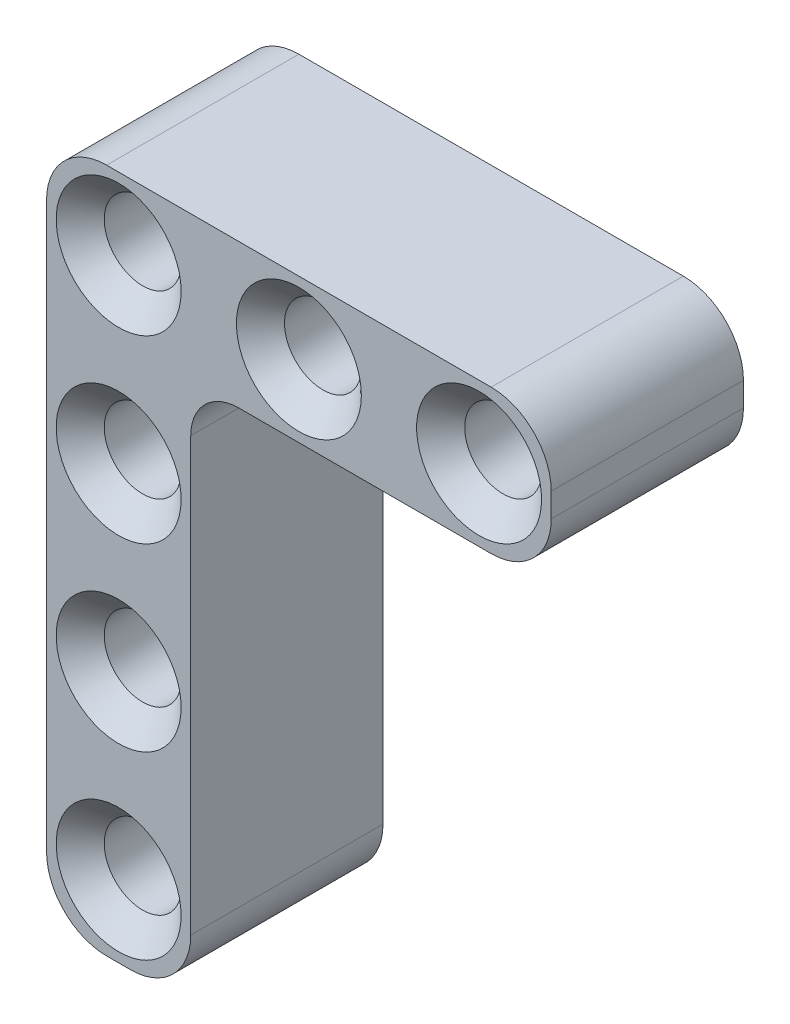
ISO-10303-21;
HEADER;
FILE_DESCRIPTION(('STEP AP214'),'2;1');
FILE_NAME('part.step','',(''),(''),'','','');
FILE_SCHEMA(('AUTOMOTIVE_DESIGN { 1 0 10303 214 1 1 1 1 }'));
ENDSEC;
DATA;
#1=APPLICATION_CONTEXT('core data for automotive mechanical design processes');
#2=APPLICATION_PROTOCOL_DEFINITION('international standard','automotive_design',2000,#1);
#3=PRODUCT_CONTEXT('',#1,'mechanical');
#4=PRODUCT('Part','Part','',(#3));
#5=PRODUCT_RELATED_PRODUCT_CATEGORY('part','',(#4));
#6=PRODUCT_DEFINITION_FORMATION('','',#4);
#7=PRODUCT_DEFINITION_CONTEXT('part definition',#1,'design');
#8=PRODUCT_DEFINITION('design','',#6,#7);
#9=PRODUCT_DEFINITION_SHAPE('','',#8);
#10=(LENGTH_UNIT() NAMED_UNIT(*) SI_UNIT(.MILLI.,.METRE.));
#11=(NAMED_UNIT(*) PLANE_ANGLE_UNIT() SI_UNIT($,.RADIAN.));
#12=(NAMED_UNIT(*) SI_UNIT($,.STERADIAN.) SOLID_ANGLE_UNIT());
#13=UNCERTAINTY_MEASURE_WITH_UNIT(LENGTH_MEASURE(1.E-05),#10,'distance_accuracy_value','');
#14=(GEOMETRIC_REPRESENTATION_CONTEXT(3) GLOBAL_UNCERTAINTY_ASSIGNED_CONTEXT((#13)) GLOBAL_UNIT_ASSIGNED_CONTEXT((#10,
#11,#12)) REPRESENTATION_CONTEXT('',''));
#15=CARTESIAN_POINT('',(0.,0.,0.));
#16=DIRECTION('',(0.,0.,1.));
#17=DIRECTION('',(1.,0.,0.));
#18=AXIS2_PLACEMENT_3D('',#15,#16,#17);
#19=CARTESIAN_POINT('',(15.5,-0.5,8.));
#20=DIRECTION('',(0.,0.,1.));
#21=DIRECTION('',(1.,0.,0.));
#22=AXIS2_PLACEMENT_3D('',#19,#20,#21);
#23=PLANE('',#22);
#24=CARTESIAN_POINT('',(0.,-7.5,8.));
#25=DIRECTION('',(0.,0.,1.));
#26=DIRECTION('',(1.,0.,0.));
#27=AXIS2_PLACEMENT_3D('',#24,#25,#26);
#28=CIRCLE('',#27,2.60000000000002);
#29=CARTESIAN_POINT('',(2.60000000000005,-7.5,8.));
#30=VERTEX_POINT('',#29);
#31=EDGE_CURVE('E270',#30,#30,#28,.F.);
#32=ORIENTED_EDGE('',*,*,#31,.T.);
#33=EDGE_LOOP('',(#32));
#34=FACE_BOUND('',#33,.T.);
#35=CARTESIAN_POINT('',(1.10050857315969E-13,-15.,8.));
#36=DIRECTION('',(0.,0.,1.));
#37=DIRECTION('',(1.,0.,0.));
#38=AXIS2_PLACEMENT_3D('',#35,#36,#37);
#39=CIRCLE('',#38,2.60000000000001);
#40=CARTESIAN_POINT('',(2.60000000000012,-15.,8.));
#41=VERTEX_POINT('',#40);
#42=EDGE_CURVE('E267',#41,#41,#39,.F.);
#43=ORIENTED_EDGE('',*,*,#42,.T.);
#44=EDGE_LOOP('',(#43));
#45=FACE_BOUND('',#44,.T.);
#46=CARTESIAN_POINT('',(1.88609187439939E-13,-22.5,8.));
#47=DIRECTION('',(0.,0.,1.));
#48=DIRECTION('',(1.,0.,0.));
#49=AXIS2_PLACEMENT_3D('',#46,#47,#48);
#50=CIRCLE('',#49,2.60000000000002);
#51=CARTESIAN_POINT('',(2.6000000000002,-22.5,8.));
#52=VERTEX_POINT('',#51);
#53=EDGE_CURVE('E264',#52,#52,#50,.F.);
#54=ORIENTED_EDGE('',*,*,#53,.T.);
#55=EDGE_LOOP('',(#54));
#56=FACE_BOUND('',#55,.T.);
#57=CARTESIAN_POINT('',(15.,0.,8.));
#58=DIRECTION('',(0.,0.,1.));
#59=DIRECTION('',(1.,0.,0.));
#60=AXIS2_PLACEMENT_3D('',#57,#58,#59);
#61=CIRCLE('',#60,2.6);
#62=CARTESIAN_POINT('',(17.6,0.,8.));
#63=VERTEX_POINT('',#62);
#64=EDGE_CURVE('E236',#63,#63,#61,.F.);
#65=ORIENTED_EDGE('',*,*,#64,.T.);
#66=EDGE_LOOP('',(#65));
#67=FACE_BOUND('',#66,.T.);
#68=CARTESIAN_POINT('',(7.5,0.,8.));
#69=DIRECTION('',(0.,0.,1.));
#70=DIRECTION('',(1.,0.,0.));
#71=AXIS2_PLACEMENT_3D('',#68,#69,#70);
#72=CIRCLE('',#71,2.6);
#73=CARTESIAN_POINT('',(10.1,0.,8.));
#74=VERTEX_POINT('',#73);
#75=EDGE_CURVE('E233',#74,#74,#72,.F.);
#76=ORIENTED_EDGE('',*,*,#75,.T.);
#77=EDGE_LOOP('',(#76));
#78=FACE_BOUND('',#77,.T.);
#79=CARTESIAN_POINT('',(0.,0.,8.));
#80=DIRECTION('',(0.,0.,1.));
#81=DIRECTION('',(1.,0.,0.));
#82=AXIS2_PLACEMENT_3D('',#79,#80,#81);
#83=CIRCLE('',#82,2.6);
#84=CARTESIAN_POINT('',(2.6,0.,8.));
#85=VERTEX_POINT('',#84);
#86=EDGE_CURVE('E230',#85,#85,#83,.F.);
#87=ORIENTED_EDGE('',*,*,#86,.T.);
#88=EDGE_LOOP('',(#87));
#89=FACE_BOUND('',#88,.T.);
#90=CARTESIAN_POINT('',(15.5,-0.5,8.));
#91=DIRECTION('',(0.,0.,1.));
#92=DIRECTION('',(1.,0.,0.));
#93=AXIS2_PLACEMENT_3D('',#90,#91,#92);
#94=CIRCLE('',#93,2.5);
#95=CARTESIAN_POINT('',(15.5,-3.,8.));
#96=VERTEX_POINT('',#95);
#97=CARTESIAN_POINT('',(18.,-0.5,8.));
#98=VERTEX_POINT('',#97);
#99=EDGE_CURVE('E168',#96,#98,#94,.T.);
#100=ORIENTED_EDGE('',*,*,#99,.T.);
#101=DIRECTION('',(0.,1.,0.));
#102=VECTOR('',#101,1.);
#103=CARTESIAN_POINT('',(18.,0.5,8.));
#104=LINE('',#103,#102);
#105=CARTESIAN_POINT('',(18.,0.5,8.));
#106=VERTEX_POINT('',#105);
#107=EDGE_CURVE('E171',#98,#106,#104,.T.);
#108=ORIENTED_EDGE('',*,*,#107,.T.);
#109=CARTESIAN_POINT('',(15.5,0.5,8.));
#110=DIRECTION('',(0.,0.,1.));
#111=DIRECTION('',(-1.,0.,0.));
#112=AXIS2_PLACEMENT_3D('',#109,#110,#111);
#113=CIRCLE('',#112,2.5);
#114=CARTESIAN_POINT('',(15.5,3.,8.));
#115=VERTEX_POINT('',#114);
#116=EDGE_CURVE('E174',#106,#115,#113,.T.);
#117=ORIENTED_EDGE('',*,*,#116,.T.);
#118=DIRECTION('',(-1.,0.,0.));
#119=VECTOR('',#118,1.);
#120=CARTESIAN_POINT('',(-0.5,3.,8.));
#121=LINE('',#120,#119);
#122=CARTESIAN_POINT('',(-0.5,3.,8.));
#123=VERTEX_POINT('',#122);
#124=EDGE_CURVE('E176',#115,#123,#121,.T.);
#125=ORIENTED_EDGE('',*,*,#124,.T.);
#126=CARTESIAN_POINT('',(-0.5,0.5,8.));
#127=DIRECTION('',(0.,0.,1.));
#128=DIRECTION('',(1.,0.,0.));
#129=AXIS2_PLACEMENT_3D('',#126,#127,#128);
#130=CIRCLE('',#129,2.5);
#131=CARTESIAN_POINT('',(-3.,0.5,8.));
#132=VERTEX_POINT('',#131);
#133=EDGE_CURVE('E178',#123,#132,#130,.T.);
#134=ORIENTED_EDGE('',*,*,#133,.T.);
#135=DIRECTION('',(0.,-1.,0.));
#136=VECTOR('',#135,1.);
#137=CARTESIAN_POINT('',(-3.,0.5,8.));
#138=LINE('',#137,#136);
#139=CARTESIAN_POINT('',(-2.99999999999991,-23.,8.));
#140=VERTEX_POINT('',#139);
#141=EDGE_CURVE('E180',#132,#140,#138,.T.);
#142=ORIENTED_EDGE('',*,*,#141,.T.);
#143=CARTESIAN_POINT('',(-0.499999999999911,-23.,8.));
#144=DIRECTION('',(0.,0.,1.));
#145=DIRECTION('',(1.,0.,0.));
#146=AXIS2_PLACEMENT_3D('',#143,#144,#145);
#147=CIRCLE('',#146,2.5);
#148=CARTESIAN_POINT('',(-0.499999999999901,-25.5,8.));
#149=VERTEX_POINT('',#148);
#150=EDGE_CURVE('E150',#140,#149,#147,.T.);
#151=ORIENTED_EDGE('',*,*,#150,.T.);
#152=DIRECTION('',(1.,0.,0.));
#153=VECTOR('',#152,1.);
#154=CARTESIAN_POINT('',(1.76941794549634E-13,-25.5,8.));
#155=LINE('',#154,#153);
#156=CARTESIAN_POINT('',(0.500000000000099,-25.5,8.));
#157=VERTEX_POINT('',#156);
#158=EDGE_CURVE('E158',#149,#157,#155,.T.);
#159=ORIENTED_EDGE('',*,*,#158,.T.);
#160=CARTESIAN_POINT('',(0.50000000000009,-23.,8.));
#161=DIRECTION('',(0.,0.,1.));
#162=DIRECTION('',(1.,0.,0.));
#163=AXIS2_PLACEMENT_3D('',#160,#161,#162);
#164=CIRCLE('',#163,2.5);
#165=CARTESIAN_POINT('',(3.00000000000009,-23.,8.));
#166=VERTEX_POINT('',#165);
#167=EDGE_CURVE('E129',#157,#166,#164,.T.);
#168=ORIENTED_EDGE('',*,*,#167,.T.);
#169=DIRECTION('',(0.,1.,0.));
#170=VECTOR('',#169,1.);
#171=CARTESIAN_POINT('',(3.,0.,8.));
#172=LINE('',#171,#170);
#173=CARTESIAN_POINT('',(3.00000000000002,-5.00000000000001,8.));
#174=VERTEX_POINT('',#173);
#175=EDGE_CURVE('E153',#166,#174,#172,.T.);
#176=ORIENTED_EDGE('',*,*,#175,.T.);
#177=CARTESIAN_POINT('',(5.00000000000002,-5.,8.));
#178=DIRECTION('',(0.,0.,1.));
#179=DIRECTION('',(1.,0.,0.));
#180=AXIS2_PLACEMENT_3D('',#177,#178,#179);
#181=CIRCLE('',#180,2.);
#182=CARTESIAN_POINT('',(5.00000000000002,-3.,8.));
#183=VERTEX_POINT('',#182);
#184=EDGE_CURVE('E58',#174,#183,#181,.F.);
#185=ORIENTED_EDGE('',*,*,#184,.T.);
#186=DIRECTION('',(1.,0.,0.));
#187=VECTOR('',#186,1.);
#188=CARTESIAN_POINT('',(-0.5,-3.,8.));
#189=LINE('',#188,#187);
#190=EDGE_CURVE('E182',#183,#96,#189,.T.);
#191=ORIENTED_EDGE('',*,*,#190,.T.);
#192=EDGE_LOOP('',(#100,#108,#117,#125,#134,#142,#151,#159,#168,#176,#185,#191));
#193=FACE_BOUND('',#192,.T.);
#194=ADVANCED_FACE('F35',(#34,#45,#56,#67,#78,#89,#193),#23,.T.);
#195=CARTESIAN_POINT('',(15.5,-0.5,0.));
#196=DIRECTION('',(0.,0.,1.));
#197=DIRECTION('',(1.,0.,0.));
#198=AXIS2_PLACEMENT_3D('',#195,#196,#197);
#199=PLANE('',#198);
#200=CARTESIAN_POINT('',(0.,-7.5,0.));
#201=DIRECTION('',(0.,0.,1.));
#202=DIRECTION('',(1.,0.,0.));
#203=AXIS2_PLACEMENT_3D('',#200,#201,#202);
#204=CIRCLE('',#203,2.6);
#205=CARTESIAN_POINT('',(2.60000000000003,-7.5,0.));
#206=VERTEX_POINT('',#205);
#207=EDGE_CURVE('E279',#206,#206,#204,.T.);
#208=ORIENTED_EDGE('',*,*,#207,.T.);
#209=EDGE_LOOP('',(#208));
#210=FACE_BOUND('',#209,.T.);
#211=CARTESIAN_POINT('',(1.10050857315969E-13,-15.,0.));
#212=DIRECTION('',(0.,0.,1.));
#213=DIRECTION('',(1.,0.,0.));
#214=AXIS2_PLACEMENT_3D('',#211,#212,#213);
#215=CIRCLE('',#214,2.6);
#216=CARTESIAN_POINT('',(2.60000000000011,-15.,0.));
#217=VERTEX_POINT('',#216);
#218=EDGE_CURVE('E276',#217,#217,#215,.T.);
#219=ORIENTED_EDGE('',*,*,#218,.T.);
#220=EDGE_LOOP('',(#219));
#221=FACE_BOUND('',#220,.T.);
#222=CARTESIAN_POINT('',(1.88609187439939E-13,-22.5,0.));
#223=DIRECTION('',(0.,0.,1.));
#224=DIRECTION('',(1.,0.,0.));
#225=AXIS2_PLACEMENT_3D('',#222,#223,#224);
#226=CIRCLE('',#225,2.6);
#227=CARTESIAN_POINT('',(2.60000000000019,-22.5,0.));
#228=VERTEX_POINT('',#227);
#229=EDGE_CURVE('E273',#228,#228,#226,.T.);
#230=ORIENTED_EDGE('',*,*,#229,.T.);
#231=EDGE_LOOP('',(#230));
#232=FACE_BOUND('',#231,.T.);
#233=CARTESIAN_POINT('',(15.,0.,0.));
#234=DIRECTION('',(0.,0.,1.));
#235=DIRECTION('',(1.,0.,0.));
#236=AXIS2_PLACEMENT_3D('',#233,#234,#235);
#237=CIRCLE('',#236,2.6);
#238=CARTESIAN_POINT('',(17.6,0.,0.));
#239=VERTEX_POINT('',#238);
#240=EDGE_CURVE('E221',#239,#239,#237,.T.);
#241=ORIENTED_EDGE('',*,*,#240,.T.);
#242=EDGE_LOOP('',(#241));
#243=FACE_BOUND('',#242,.T.);
#244=CARTESIAN_POINT('',(7.5,0.,0.));
#245=DIRECTION('',(0.,0.,1.));
#246=DIRECTION('',(1.,0.,0.));
#247=AXIS2_PLACEMENT_3D('',#244,#245,#246);
#248=CIRCLE('',#247,2.6);
#249=CARTESIAN_POINT('',(10.1,0.,0.));
#250=VERTEX_POINT('',#249);
#251=EDGE_CURVE('E218',#250,#250,#248,.T.);
#252=ORIENTED_EDGE('',*,*,#251,.T.);
#253=EDGE_LOOP('',(#252));
#254=FACE_BOUND('',#253,.T.);
#255=CARTESIAN_POINT('',(0.,0.,0.));
#256=DIRECTION('',(0.,0.,1.));
#257=DIRECTION('',(1.,0.,0.));
#258=AXIS2_PLACEMENT_3D('',#255,#256,#257);
#259=CIRCLE('',#258,2.6);
#260=CARTESIAN_POINT('',(2.6,0.,0.));
#261=VERTEX_POINT('',#260);
#262=EDGE_CURVE('E215',#261,#261,#259,.T.);
#263=ORIENTED_EDGE('',*,*,#262,.T.);
#264=EDGE_LOOP('',(#263));
#265=FACE_BOUND('',#264,.T.);
#266=CARTESIAN_POINT('',(15.5,-0.5,0.));
#267=DIRECTION('',(0.,0.,1.));
#268=DIRECTION('',(1.,0.,0.));
#269=AXIS2_PLACEMENT_3D('',#266,#267,#268);
#270=CIRCLE('',#269,2.5);
#271=CARTESIAN_POINT('',(15.5,-3.,0.));
#272=VERTEX_POINT('',#271);
#273=CARTESIAN_POINT('',(18.,-0.5,0.));
#274=VERTEX_POINT('',#273);
#275=EDGE_CURVE('E163',#272,#274,#270,.T.);
#276=ORIENTED_EDGE('',*,*,#275,.F.);
#277=DIRECTION('',(1.,0.,0.));
#278=VECTOR('',#277,1.);
#279=CARTESIAN_POINT('',(-0.5,-3.,0.));
#280=LINE('',#279,#278);
#281=CARTESIAN_POINT('',(5.00000000000002,-3.,0.));
#282=VERTEX_POINT('',#281);
#283=EDGE_CURVE('E172',#282,#272,#280,.T.);
#284=ORIENTED_EDGE('',*,*,#283,.F.);
#285=CARTESIAN_POINT('',(5.00000000000002,-5.,0.));
#286=DIRECTION('',(0.,0.,1.));
#287=DIRECTION('',(1.,0.,0.));
#288=AXIS2_PLACEMENT_3D('',#285,#286,#287);
#289=CIRCLE('',#288,2.);
#290=CARTESIAN_POINT('',(3.00000000000002,-5.00000000000001,0.));
#291=VERTEX_POINT('',#290);
#292=EDGE_CURVE('E256',#282,#291,#289,.T.);
#293=ORIENTED_EDGE('',*,*,#292,.T.);
#294=DIRECTION('',(0.,1.,0.));
#295=VECTOR('',#294,1.);
#296=CARTESIAN_POINT('',(3.,0.,0.));
#297=LINE('',#296,#295);
#298=CARTESIAN_POINT('',(3.00000000000009,-23.,0.));
#299=VERTEX_POINT('',#298);
#300=EDGE_CURVE('E146',#299,#291,#297,.T.);
#301=ORIENTED_EDGE('',*,*,#300,.F.);
#302=CARTESIAN_POINT('',(0.50000000000009,-23.,0.));
#303=DIRECTION('',(0.,0.,1.));
#304=DIRECTION('',(1.,0.,0.));
#305=AXIS2_PLACEMENT_3D('',#302,#303,#304);
#306=CIRCLE('',#305,2.5);
#307=CARTESIAN_POINT('',(0.500000000000099,-25.5,0.));
#308=VERTEX_POINT('',#307);
#309=EDGE_CURVE('E127',#308,#299,#306,.T.);
#310=ORIENTED_EDGE('',*,*,#309,.F.);
#311=DIRECTION('',(1.,0.,0.));
#312=VECTOR('',#311,1.);
#313=CARTESIAN_POINT('',(1.76941794549634E-13,-25.5,0.));
#314=LINE('',#313,#312);
#315=CARTESIAN_POINT('',(-0.499999999999901,-25.5,0.));
#316=VERTEX_POINT('',#315);
#317=EDGE_CURVE('E143',#316,#308,#314,.T.);
#318=ORIENTED_EDGE('',*,*,#317,.F.);
#319=CARTESIAN_POINT('',(-0.499999999999911,-23.,0.));
#320=DIRECTION('',(0.,0.,1.));
#321=DIRECTION('',(1.,0.,0.));
#322=AXIS2_PLACEMENT_3D('',#319,#320,#321);
#323=CIRCLE('',#322,2.5);
#324=CARTESIAN_POINT('',(-2.99999999999991,-23.,0.));
#325=VERTEX_POINT('',#324);
#326=EDGE_CURVE('E135',#325,#316,#323,.T.);
#327=ORIENTED_EDGE('',*,*,#326,.F.);
#328=DIRECTION('',(0.,-1.,0.));
#329=VECTOR('',#328,1.);
#330=CARTESIAN_POINT('',(-3.,0.5,0.));
#331=LINE('',#330,#329);
#332=CARTESIAN_POINT('',(-3.,0.5,0.));
#333=VERTEX_POINT('',#332);
#334=EDGE_CURVE('E195',#333,#325,#331,.T.);
#335=ORIENTED_EDGE('',*,*,#334,.F.);
#336=CARTESIAN_POINT('',(-0.5,0.5,0.));
#337=DIRECTION('',(0.,0.,1.));
#338=DIRECTION('',(1.,0.,0.));
#339=AXIS2_PLACEMENT_3D('',#336,#337,#338);
#340=CIRCLE('',#339,2.5);
#341=CARTESIAN_POINT('',(-0.5,3.,0.));
#342=VERTEX_POINT('',#341);
#343=EDGE_CURVE('E193',#342,#333,#340,.T.);
#344=ORIENTED_EDGE('',*,*,#343,.F.);
#345=DIRECTION('',(-1.,0.,0.));
#346=VECTOR('',#345,1.);
#347=CARTESIAN_POINT('',(-0.5,3.,0.));
#348=LINE('',#347,#346);
#349=CARTESIAN_POINT('',(15.5,3.,0.));
#350=VERTEX_POINT('',#349);
#351=EDGE_CURVE('E191',#350,#342,#348,.T.);
#352=ORIENTED_EDGE('',*,*,#351,.F.);
#353=CARTESIAN_POINT('',(15.5,0.5,0.));
#354=DIRECTION('',(0.,0.,1.));
#355=DIRECTION('',(-1.,0.,0.));
#356=AXIS2_PLACEMENT_3D('',#353,#354,#355);
#357=CIRCLE('',#356,2.5);
#358=CARTESIAN_POINT('',(18.,0.5,0.));
#359=VERTEX_POINT('',#358);
#360=EDGE_CURVE('E189',#359,#350,#357,.T.);
#361=ORIENTED_EDGE('',*,*,#360,.F.);
#362=DIRECTION('',(0.,1.,0.));
#363=VECTOR('',#362,1.);
#364=CARTESIAN_POINT('',(18.,0.5,0.));
#365=LINE('',#364,#363);
#366=EDGE_CURVE('E187',#274,#359,#365,.T.);
#367=ORIENTED_EDGE('',*,*,#366,.F.);
#368=EDGE_LOOP('',(#276,#284,#293,#301,#310,#318,#327,#335,#344,#352,#361,#367));
#369=FACE_BOUND('',#368,.T.);
#370=ADVANCED_FACE('F141',(#210,#221,#232,#243,#254,#265,#369),#199,.F.);
#371=CARTESIAN_POINT('',(15.5,-0.5,8.));
#372=DIRECTION('',(0.,0.,-1.));
#373=DIRECTION('',(-1.,0.,0.));
#374=AXIS2_PLACEMENT_3D('',#371,#372,#373);
#375=CYLINDRICAL_SURFACE('',#374,2.5);
#376=ORIENTED_EDGE('',*,*,#275,.T.);
#377=DIRECTION('',(0.,0.,-1.));
#378=VECTOR('',#377,1.);
#379=CARTESIAN_POINT('',(18.,-0.5,8.));
#380=LINE('',#379,#378);
#381=EDGE_CURVE('E212',#98,#274,#380,.T.);
#382=ORIENTED_EDGE('',*,*,#381,.F.);
#383=ORIENTED_EDGE('',*,*,#99,.F.);
#384=DIRECTION('',(0.,0.,-1.));
#385=VECTOR('',#384,1.);
#386=CARTESIAN_POINT('',(15.5,-3.,8.));
#387=LINE('',#386,#385);
#388=EDGE_CURVE('E184',#96,#272,#387,.T.);
#389=ORIENTED_EDGE('',*,*,#388,.T.);
#390=EDGE_LOOP('',(#376,#382,#383,#389));
#391=FACE_BOUND('',#390,.T.);
#392=ADVANCED_FACE('F299',(#391),#375,.T.);
#393=CARTESIAN_POINT('',(18.,0.5,8.));
#394=DIRECTION('',(-1.,0.,0.));
#395=DIRECTION('',(0.,0.,1.));
#396=AXIS2_PLACEMENT_3D('',#393,#394,#395);
#397=PLANE('',#396);
#398=ORIENTED_EDGE('',*,*,#366,.T.);
#399=DIRECTION('',(0.,0.,-1.));
#400=VECTOR('',#399,1.);
#401=CARTESIAN_POINT('',(18.,0.5,8.));
#402=LINE('',#401,#400);
#403=EDGE_CURVE('E209',#106,#359,#402,.T.);
#404=ORIENTED_EDGE('',*,*,#403,.F.);
#405=ORIENTED_EDGE('',*,*,#107,.F.);
#406=ORIENTED_EDGE('',*,*,#381,.T.);
#407=EDGE_LOOP('',(#398,#404,#405,#406));
#408=FACE_BOUND('',#407,.T.);
#409=ADVANCED_FACE('F352',(#408),#397,.F.);
#410=CARTESIAN_POINT('',(15.5,0.5,8.));
#411=DIRECTION('',(0.,0.,-1.));
#412=DIRECTION('',(-1.,0.,0.));
#413=AXIS2_PLACEMENT_3D('',#410,#411,#412);
#414=CYLINDRICAL_SURFACE('',#413,2.5);
#415=ORIENTED_EDGE('',*,*,#360,.T.);
#416=DIRECTION('',(0.,0.,-1.));
#417=VECTOR('',#416,1.);
#418=CARTESIAN_POINT('',(15.5,3.,8.));
#419=LINE('',#418,#417);
#420=EDGE_CURVE('E206',#115,#350,#419,.T.);
#421=ORIENTED_EDGE('',*,*,#420,.F.);
#422=ORIENTED_EDGE('',*,*,#116,.F.);
#423=ORIENTED_EDGE('',*,*,#403,.T.);
#424=EDGE_LOOP('',(#415,#421,#422,#423));
#425=FACE_BOUND('',#424,.T.);
#426=ADVANCED_FACE('F348',(#425),#414,.T.);
#427=CARTESIAN_POINT('',(-0.5,3.,8.));
#428=DIRECTION('',(0.,-1.,0.));
#429=DIRECTION('',(1.,0.,0.));
#430=AXIS2_PLACEMENT_3D('',#427,#428,#429);
#431=PLANE('',#430);
#432=ORIENTED_EDGE('',*,*,#351,.T.);
#433=DIRECTION('',(0.,0.,-1.));
#434=VECTOR('',#433,1.);
#435=CARTESIAN_POINT('',(-0.5,3.,8.));
#436=LINE('',#435,#434);
#437=EDGE_CURVE('E203',#123,#342,#436,.T.);
#438=ORIENTED_EDGE('',*,*,#437,.F.);
#439=ORIENTED_EDGE('',*,*,#124,.F.);
#440=ORIENTED_EDGE('',*,*,#420,.T.);
#441=EDGE_LOOP('',(#432,#438,#439,#440));
#442=FACE_BOUND('',#441,.T.);
#443=ADVANCED_FACE('F344',(#442),#431,.F.);
#444=CARTESIAN_POINT('',(-0.5,0.5,8.));
#445=DIRECTION('',(0.,0.,-1.));
#446=DIRECTION('',(-1.,0.,0.));
#447=AXIS2_PLACEMENT_3D('',#444,#445,#446);
#448=CYLINDRICAL_SURFACE('',#447,2.5);
#449=ORIENTED_EDGE('',*,*,#343,.T.);
#450=DIRECTION('',(0.,0.,-1.));
#451=VECTOR('',#450,1.);
#452=CARTESIAN_POINT('',(-3.,0.5,8.));
#453=LINE('',#452,#451);
#454=EDGE_CURVE('E200',#132,#333,#453,.T.);
#455=ORIENTED_EDGE('',*,*,#454,.F.);
#456=ORIENTED_EDGE('',*,*,#133,.F.);
#457=ORIENTED_EDGE('',*,*,#437,.T.);
#458=EDGE_LOOP('',(#449,#455,#456,#457));
#459=FACE_BOUND('',#458,.T.);
#460=ADVANCED_FACE('F340',(#459),#448,.T.);
#461=CARTESIAN_POINT('',(-3.,0.5,8.));
#462=DIRECTION('',(1.,0.,0.));
#463=DIRECTION('',(0.,0.,-1.));
#464=AXIS2_PLACEMENT_3D('',#461,#462,#463);
#465=PLANE('',#464);
#466=ORIENTED_EDGE('',*,*,#334,.T.);
#467=DIRECTION('',(0.,0.,1.));
#468=VECTOR('',#467,1.);
#469=CARTESIAN_POINT('',(-2.99999999999991,-23.,0.));
#470=LINE('',#469,#468);
#471=EDGE_CURVE('E164',#325,#140,#470,.T.);
#472=ORIENTED_EDGE('',*,*,#471,.T.);
#473=ORIENTED_EDGE('',*,*,#141,.F.);
#474=ORIENTED_EDGE('',*,*,#454,.T.);
#475=EDGE_LOOP('',(#466,#472,#473,#474));
#476=FACE_BOUND('',#475,.T.);
#477=ADVANCED_FACE('F337',(#476),#465,.F.);
#478=CARTESIAN_POINT('',(-0.5,-3.,8.));
#479=DIRECTION('',(0.,1.,0.));
#480=DIRECTION('',(-1.,0.,0.));
#481=AXIS2_PLACEMENT_3D('',#478,#479,#480);
#482=PLANE('',#481);
#483=ORIENTED_EDGE('',*,*,#190,.F.);
#484=DIRECTION('',(0.,0.,1.));
#485=VECTOR('',#484,1.);
#486=CARTESIAN_POINT('',(5.00000000000002,-3.,8.));
#487=LINE('',#486,#485);
#488=EDGE_CURVE('E50',#183,#282,#487,.F.);
#489=ORIENTED_EDGE('',*,*,#488,.T.);
#490=ORIENTED_EDGE('',*,*,#283,.T.);
#491=ORIENTED_EDGE('',*,*,#388,.F.);
#492=EDGE_LOOP('',(#483,#489,#490,#491));
#493=FACE_BOUND('',#492,.T.);
#494=ADVANCED_FACE('F334',(#493),#482,.F.);
#495=CARTESIAN_POINT('',(0.,0.,8.));
#496=DIRECTION('',(0.,0.,-1.));
#497=DIRECTION('',(-1.,0.,0.));
#498=AXIS2_PLACEMENT_3D('',#495,#496,#497);
#499=CYLINDRICAL_SURFACE('',#498,1.6);
#500=CARTESIAN_POINT('',(0.,0.,1.00000000000001));
#501=DIRECTION('',(0.,0.,1.));
#502=DIRECTION('',(1.,0.,0.));
#503=AXIS2_PLACEMENT_3D('',#500,#501,#502);
#504=CIRCLE('',#503,1.6);
#505=CARTESIAN_POINT('',(1.6,0.,1.00000000000001));
#506=VERTEX_POINT('',#505);
#507=EDGE_CURVE('E248',#506,#506,#504,.F.);
#508=ORIENTED_EDGE('',*,*,#507,.T.);
#509=EDGE_LOOP('',(#508));
#510=FACE_BOUND('',#509,.T.);
#511=CARTESIAN_POINT('',(0.,0.,7.));
#512=DIRECTION('',(0.,0.,1.));
#513=DIRECTION('',(1.,0.,0.));
#514=AXIS2_PLACEMENT_3D('',#511,#512,#513);
#515=CIRCLE('',#514,1.6);
#516=CARTESIAN_POINT('',(1.6,0.,7.));
#517=VERTEX_POINT('',#516);
#518=EDGE_CURVE('E245',#517,#517,#515,.T.);
#519=ORIENTED_EDGE('',*,*,#518,.T.);
#520=EDGE_LOOP('',(#519));
#521=FACE_BOUND('',#520,.T.);
#522=ADVANCED_FACE('F331',(#510,#521),#499,.F.);
#523=CARTESIAN_POINT('',(7.5,0.,8.));
#524=DIRECTION('',(0.,0.,-1.));
#525=DIRECTION('',(-1.,0.,0.));
#526=AXIS2_PLACEMENT_3D('',#523,#524,#525);
#527=CYLINDRICAL_SURFACE('',#526,1.6);
#528=CARTESIAN_POINT('',(7.5,0.,1.));
#529=DIRECTION('',(0.,0.,1.));
#530=DIRECTION('',(1.,0.,0.));
#531=AXIS2_PLACEMENT_3D('',#528,#529,#530);
#532=CIRCLE('',#531,1.6);
#533=CARTESIAN_POINT('',(9.1,0.,1.));
#534=VERTEX_POINT('',#533);
#535=EDGE_CURVE('E242',#534,#534,#532,.F.);
#536=ORIENTED_EDGE('',*,*,#535,.T.);
#537=EDGE_LOOP('',(#536));
#538=FACE_BOUND('',#537,.T.);
#539=CARTESIAN_POINT('',(7.5,0.,7.));
#540=DIRECTION('',(0.,0.,1.));
#541=DIRECTION('',(1.,0.,0.));
#542=AXIS2_PLACEMENT_3D('',#539,#540,#541);
#543=CIRCLE('',#542,1.6);
#544=CARTESIAN_POINT('',(9.1,0.,7.));
#545=VERTEX_POINT('',#544);
#546=EDGE_CURVE('E239',#545,#545,#543,.T.);
#547=ORIENTED_EDGE('',*,*,#546,.T.);
#548=EDGE_LOOP('',(#547));
#549=FACE_BOUND('',#548,.T.);
#550=ADVANCED_FACE('F376',(#538,#549),#527,.F.);
#551=CARTESIAN_POINT('',(15.,0.,8.));
#552=DIRECTION('',(0.,0.,-1.));
#553=DIRECTION('',(-1.,0.,0.));
#554=AXIS2_PLACEMENT_3D('',#551,#552,#553);
#555=CYLINDRICAL_SURFACE('',#554,1.6);
#556=CARTESIAN_POINT('',(15.,0.,1.));
#557=DIRECTION('',(0.,0.,1.));
#558=DIRECTION('',(1.,0.,0.));
#559=AXIS2_PLACEMENT_3D('',#556,#557,#558);
#560=CIRCLE('',#559,1.6);
#561=CARTESIAN_POINT('',(16.6,0.,1.));
#562=VERTEX_POINT('',#561);
#563=EDGE_CURVE('E227',#562,#562,#560,.F.);
#564=ORIENTED_EDGE('',*,*,#563,.T.);
#565=EDGE_LOOP('',(#564));
#566=FACE_BOUND('',#565,.T.);
#567=CARTESIAN_POINT('',(15.,0.,7.));
#568=DIRECTION('',(0.,0.,1.));
#569=DIRECTION('',(1.,0.,0.));
#570=AXIS2_PLACEMENT_3D('',#567,#568,#569);
#571=CIRCLE('',#570,1.6);
#572=CARTESIAN_POINT('',(16.6,0.,7.));
#573=VERTEX_POINT('',#572);
#574=EDGE_CURVE('E224',#573,#573,#571,.T.);
#575=ORIENTED_EDGE('',*,*,#574,.T.);
#576=EDGE_LOOP('',(#575));
#577=FACE_BOUND('',#576,.T.);
#578=ADVANCED_FACE('F364',(#566,#577),#555,.F.);
#579=CARTESIAN_POINT('',(15.,0.,0.));
#580=DIRECTION('',(0.,0.,-1.));
#581=DIRECTION('',(-1.,0.,0.));
#582=AXIS2_PLACEMENT_3D('',#579,#580,#581);
#583=CONICAL_SURFACE('',#582,2.6,0.785398163397447);
#584=ORIENTED_EDGE('',*,*,#563,.F.);
#585=EDGE_LOOP('',(#584));
#586=FACE_BOUND('',#585,.T.);
#587=ORIENTED_EDGE('',*,*,#240,.F.);
#588=EDGE_LOOP('',(#587));
#589=FACE_BOUND('',#588,.T.);
#590=ADVANCED_FACE('F360',(#586,#589),#583,.F.);
#591=CARTESIAN_POINT('',(15.,0.,7.));
#592=DIRECTION('',(0.,0.,1.));
#593=DIRECTION('',(1.,0.,0.));
#594=AXIS2_PLACEMENT_3D('',#591,#592,#593);
#595=CONICAL_SURFACE('',#594,1.6,0.78539816339745);
#596=ORIENTED_EDGE('',*,*,#64,.F.);
#597=EDGE_LOOP('',(#596));
#598=FACE_BOUND('',#597,.T.);
#599=ORIENTED_EDGE('',*,*,#574,.F.);
#600=EDGE_LOOP('',(#599));
#601=FACE_BOUND('',#600,.T.);
#602=ADVANCED_FACE('F363',(#598,#601),#595,.F.);
#603=CARTESIAN_POINT('',(7.5,0.,0.));
#604=DIRECTION('',(0.,0.,-1.));
#605=DIRECTION('',(-1.,0.,0.));
#606=AXIS2_PLACEMENT_3D('',#603,#604,#605);
#607=CONICAL_SURFACE('',#606,2.6,0.785398163397445);
#608=ORIENTED_EDGE('',*,*,#535,.F.);
#609=EDGE_LOOP('',(#608));
#610=FACE_BOUND('',#609,.T.);
#611=ORIENTED_EDGE('',*,*,#251,.F.);
#612=EDGE_LOOP('',(#611));
#613=FACE_BOUND('',#612,.T.);
#614=ADVANCED_FACE('F320',(#610,#613),#607,.F.);
#615=CARTESIAN_POINT('',(7.5,0.,7.));
#616=DIRECTION('',(0.,0.,1.));
#617=DIRECTION('',(1.,0.,0.));
#618=AXIS2_PLACEMENT_3D('',#615,#616,#617);
#619=CONICAL_SURFACE('',#618,1.6,0.785398163397451);
#620=ORIENTED_EDGE('',*,*,#75,.F.);
#621=EDGE_LOOP('',(#620));
#622=FACE_BOUND('',#621,.T.);
#623=ORIENTED_EDGE('',*,*,#546,.F.);
#624=EDGE_LOOP('',(#623));
#625=FACE_BOUND('',#624,.T.);
#626=ADVANCED_FACE('F311',(#622,#625),#619,.F.);
#627=CARTESIAN_POINT('',(0.,0.,0.));
#628=DIRECTION('',(0.,0.,-1.));
#629=DIRECTION('',(-1.,0.,0.));
#630=AXIS2_PLACEMENT_3D('',#627,#628,#629);
#631=CONICAL_SURFACE('',#630,2.6,0.785398163397445);
#632=ORIENTED_EDGE('',*,*,#507,.F.);
#633=EDGE_LOOP('',(#632));
#634=FACE_BOUND('',#633,.T.);
#635=ORIENTED_EDGE('',*,*,#262,.F.);
#636=EDGE_LOOP('',(#635));
#637=FACE_BOUND('',#636,.T.);
#638=ADVANCED_FACE('F308',(#634,#637),#631,.F.);
#639=CARTESIAN_POINT('',(0.,0.,7.));
#640=DIRECTION('',(0.,0.,1.));
#641=DIRECTION('',(1.,0.,0.));
#642=AXIS2_PLACEMENT_3D('',#639,#640,#641);
#643=CONICAL_SURFACE('',#642,1.6,0.785398163397451);
#644=ORIENTED_EDGE('',*,*,#86,.F.);
#645=EDGE_LOOP('',(#644));
#646=FACE_BOUND('',#645,.T.);
#647=ORIENTED_EDGE('',*,*,#518,.F.);
#648=EDGE_LOOP('',(#647));
#649=FACE_BOUND('',#648,.T.);
#650=ADVANCED_FACE('F310',(#646,#649),#643,.F.);
#651=CARTESIAN_POINT('',(1.76941794549634E-13,-25.5,0.));
#652=DIRECTION('',(0.,-1.,0.));
#653=DIRECTION('',(1.,0.,0.));
#654=AXIS2_PLACEMENT_3D('',#651,#652,#653);
#655=PLANE('',#654);
#656=ORIENTED_EDGE('',*,*,#158,.F.);
#657=DIRECTION('',(0.,0.,1.));
#658=VECTOR('',#657,1.);
#659=CARTESIAN_POINT('',(-0.499999999999901,-25.5,0.));
#660=LINE('',#659,#658);
#661=EDGE_CURVE('E149',#316,#149,#660,.T.);
#662=ORIENTED_EDGE('',*,*,#661,.F.);
#663=ORIENTED_EDGE('',*,*,#317,.T.);
#664=DIRECTION('',(0.,0.,1.));
#665=VECTOR('',#664,1.);
#666=CARTESIAN_POINT('',(0.500000000000099,-25.5,0.));
#667=LINE('',#666,#665);
#668=EDGE_CURVE('E124',#308,#157,#667,.T.);
#669=ORIENTED_EDGE('',*,*,#668,.T.);
#670=EDGE_LOOP('',(#656,#662,#663,#669));
#671=FACE_BOUND('',#670,.T.);
#672=ADVANCED_FACE('F148',(#671),#655,.T.);
#673=CARTESIAN_POINT('',(-0.499999999999911,-23.,0.));
#674=DIRECTION('',(0.,0.,1.));
#675=DIRECTION('',(1.,0.,0.));
#676=AXIS2_PLACEMENT_3D('',#673,#674,#675);
#677=CYLINDRICAL_SURFACE('',#676,2.5);
#678=ORIENTED_EDGE('',*,*,#150,.F.);
#679=ORIENTED_EDGE('',*,*,#471,.F.);
#680=ORIENTED_EDGE('',*,*,#326,.T.);
#681=ORIENTED_EDGE('',*,*,#661,.T.);
#682=EDGE_LOOP('',(#678,#679,#680,#681));
#683=FACE_BOUND('',#682,.T.);
#684=ADVANCED_FACE('F403',(#683),#677,.T.);
#685=CARTESIAN_POINT('',(3.,0.,0.));
#686=DIRECTION('',(1.,0.,0.));
#687=DIRECTION('',(0.,1.,0.));
#688=AXIS2_PLACEMENT_3D('',#685,#686,#687);
#689=PLANE('',#688);
#690=ORIENTED_EDGE('',*,*,#300,.T.);
#691=DIRECTION('',(0.,0.,1.));
#692=VECTOR('',#691,1.);
#693=CARTESIAN_POINT('',(3.00000000000002,-5.00000000000001,0.));
#694=LINE('',#693,#692);
#695=EDGE_CURVE('E251',#291,#174,#694,.T.);
#696=ORIENTED_EDGE('',*,*,#695,.T.);
#697=ORIENTED_EDGE('',*,*,#175,.F.);
#698=DIRECTION('',(0.,0.,1.));
#699=VECTOR('',#698,1.);
#700=CARTESIAN_POINT('',(3.00000000000009,-23.,0.));
#701=LINE('',#700,#699);
#702=EDGE_CURVE('E134',#299,#166,#701,.T.);
#703=ORIENTED_EDGE('',*,*,#702,.F.);
#704=EDGE_LOOP('',(#690,#696,#697,#703));
#705=FACE_BOUND('',#704,.T.);
#706=ADVANCED_FACE('F399',(#705),#689,.T.);
#707=CARTESIAN_POINT('',(0.,-7.5,0.));
#708=DIRECTION('',(0.,0.,1.));
#709=DIRECTION('',(1.,0.,0.));
#710=AXIS2_PLACEMENT_3D('',#707,#708,#709);
#711=CYLINDRICAL_SURFACE('',#710,1.6);
#712=CARTESIAN_POINT('',(0.,-7.5,6.99999999999999));
#713=DIRECTION('',(0.,0.,1.));
#714=DIRECTION('',(1.,0.,0.));
#715=AXIS2_PLACEMENT_3D('',#712,#713,#714);
#716=CIRCLE('',#715,1.6);
#717=CARTESIAN_POINT('',(1.60000000000003,-7.5,6.99999999999999));
#718=VERTEX_POINT('',#717);
#719=EDGE_CURVE('E261',#718,#718,#716,.T.);
#720=ORIENTED_EDGE('',*,*,#719,.T.);
#721=EDGE_LOOP('',(#720));
#722=FACE_BOUND('',#721,.T.);
#723=CARTESIAN_POINT('',(0.,-7.5,1.00000000000001));
#724=DIRECTION('',(0.,0.,1.));
#725=DIRECTION('',(1.,0.,0.));
#726=AXIS2_PLACEMENT_3D('',#723,#724,#725);
#727=CIRCLE('',#726,1.6);
#728=CARTESIAN_POINT('',(1.60000000000003,-7.5,1.00000000000001));
#729=VERTEX_POINT('',#728);
#730=EDGE_CURVE('E258',#729,#729,#727,.F.);
#731=ORIENTED_EDGE('',*,*,#730,.T.);
#732=EDGE_LOOP('',(#731));
#733=FACE_BOUND('',#732,.T.);
#734=ADVANCED_FACE('F395',(#722,#733),#711,.F.);
#735=CARTESIAN_POINT('',(1.10050857315969E-13,-15.,0.));
#736=DIRECTION('',(0.,0.,1.));
#737=DIRECTION('',(1.,0.,0.));
#738=AXIS2_PLACEMENT_3D('',#735,#736,#737);
#739=CYLINDRICAL_SURFACE('',#738,1.6);
#740=CARTESIAN_POINT('',(1.10050857315969E-13,-15.,6.99999999999999));
#741=DIRECTION('',(0.,0.,1.));
#742=DIRECTION('',(1.,0.,0.));
#743=AXIS2_PLACEMENT_3D('',#740,#741,#742);
#744=CIRCLE('',#743,1.6);
#745=CARTESIAN_POINT('',(1.60000000000011,-15.,6.99999999999999));
#746=VERTEX_POINT('',#745);
#747=EDGE_CURVE('E285',#746,#746,#744,.T.);
#748=ORIENTED_EDGE('',*,*,#747,.T.);
#749=EDGE_LOOP('',(#748));
#750=FACE_BOUND('',#749,.T.);
#751=CARTESIAN_POINT('',(1.10050857315969E-13,-15.,1.00000000000001));
#752=DIRECTION('',(0.,0.,1.));
#753=DIRECTION('',(1.,0.,0.));
#754=AXIS2_PLACEMENT_3D('',#751,#752,#753);
#755=CIRCLE('',#754,1.6);
#756=CARTESIAN_POINT('',(1.60000000000011,-15.,1.00000000000001));
#757=VERTEX_POINT('',#756);
#758=EDGE_CURVE('E282',#757,#757,#755,.F.);
#759=ORIENTED_EDGE('',*,*,#758,.T.);
#760=EDGE_LOOP('',(#759));
#761=FACE_BOUND('',#760,.T.);
#762=ADVANCED_FACE('F391',(#750,#761),#739,.F.);
#763=CARTESIAN_POINT('',(1.88609187439939E-13,-22.5,0.));
#764=DIRECTION('',(0.,0.,1.));
#765=DIRECTION('',(1.,0.,0.));
#766=AXIS2_PLACEMENT_3D('',#763,#764,#765);
#767=CYLINDRICAL_SURFACE('',#766,1.6);
#768=CARTESIAN_POINT('',(1.88609187439939E-13,-22.5,6.99999999999999));
#769=DIRECTION('',(0.,0.,1.));
#770=DIRECTION('',(1.,0.,0.));
#771=AXIS2_PLACEMENT_3D('',#768,#769,#770);
#772=CIRCLE('',#771,1.6);
#773=CARTESIAN_POINT('',(1.60000000000019,-22.5,6.99999999999999));
#774=VERTEX_POINT('',#773);
#775=EDGE_CURVE('E11',#774,#774,#772,.T.);
#776=ORIENTED_EDGE('',*,*,#775,.T.);
#777=EDGE_LOOP('',(#776));
#778=FACE_BOUND('',#777,.T.);
#779=CARTESIAN_POINT('',(1.88609187439939E-13,-22.5,1.00000000000001));
#780=DIRECTION('',(0.,0.,1.));
#781=DIRECTION('',(1.,0.,0.));
#782=AXIS2_PLACEMENT_3D('',#779,#780,#781);
#783=CIRCLE('',#782,1.6);
#784=CARTESIAN_POINT('',(1.60000000000019,-22.5,1.00000000000001));
#785=VERTEX_POINT('',#784);
#786=EDGE_CURVE('E43',#785,#785,#783,.F.);
#787=ORIENTED_EDGE('',*,*,#786,.T.);
#788=EDGE_LOOP('',(#787));
#789=FACE_BOUND('',#788,.T.);
#790=ADVANCED_FACE('F290',(#778,#789),#767,.F.);
#791=CARTESIAN_POINT('',(0.50000000000009,-23.,0.));
#792=DIRECTION('',(0.,0.,1.));
#793=DIRECTION('',(1.,0.,0.));
#794=AXIS2_PLACEMENT_3D('',#791,#792,#793);
#795=CYLINDRICAL_SURFACE('',#794,2.5);
#796=ORIENTED_EDGE('',*,*,#167,.F.);
#797=ORIENTED_EDGE('',*,*,#668,.F.);
#798=ORIENTED_EDGE('',*,*,#309,.T.);
#799=ORIENTED_EDGE('',*,*,#702,.T.);
#800=EDGE_LOOP('',(#796,#797,#798,#799));
#801=FACE_BOUND('',#800,.T.);
#802=ADVANCED_FACE('F126',(#801),#795,.T.);
#803=CARTESIAN_POINT('',(5.00000000000002,-5.,0.));
#804=DIRECTION('',(0.,0.,1.));
#805=DIRECTION('',(1.,0.,0.));
#806=AXIS2_PLACEMENT_3D('',#803,#804,#805);
#807=CYLINDRICAL_SURFACE('',#806,2.);
#808=ORIENTED_EDGE('',*,*,#292,.F.);
#809=ORIENTED_EDGE('',*,*,#488,.F.);
#810=ORIENTED_EDGE('',*,*,#184,.F.);
#811=ORIENTED_EDGE('',*,*,#695,.F.);
#812=EDGE_LOOP('',(#808,#809,#810,#811));
#813=FACE_BOUND('',#812,.T.);
#814=ADVANCED_FACE('F406',(#813),#807,.F.);
#815=CARTESIAN_POINT('',(0.,-7.5,6.99999999999999));
#816=DIRECTION('',(0.,0.,1.));
#817=DIRECTION('',(1.,0.,0.));
#818=AXIS2_PLACEMENT_3D('',#815,#816,#817);
#819=CONICAL_SURFACE('',#818,1.6,0.785398163397453);
#820=ORIENTED_EDGE('',*,*,#31,.F.);
#821=EDGE_LOOP('',(#820));
#822=FACE_BOUND('',#821,.T.);
#823=ORIENTED_EDGE('',*,*,#719,.F.);
#824=EDGE_LOOP('',(#823));
#825=FACE_BOUND('',#824,.T.);
#826=ADVANCED_FACE('F436',(#822,#825),#819,.F.);
#827=CARTESIAN_POINT('',(0.,-7.5,0.));
#828=DIRECTION('',(0.,0.,-1.));
#829=DIRECTION('',(-1.,0.,0.));
#830=AXIS2_PLACEMENT_3D('',#827,#828,#829);
#831=CONICAL_SURFACE('',#830,2.6,0.785398163397446);
#832=ORIENTED_EDGE('',*,*,#730,.F.);
#833=EDGE_LOOP('',(#832));
#834=FACE_BOUND('',#833,.T.);
#835=ORIENTED_EDGE('',*,*,#207,.F.);
#836=EDGE_LOOP('',(#835));
#837=FACE_BOUND('',#836,.T.);
#838=ADVANCED_FACE('F441',(#834,#837),#831,.F.);
#839=CARTESIAN_POINT('',(1.10050857315969E-13,-15.,6.99999999999999));
#840=DIRECTION('',(0.,0.,1.));
#841=DIRECTION('',(1.,0.,0.));
#842=AXIS2_PLACEMENT_3D('',#839,#840,#841);
#843=CONICAL_SURFACE('',#842,1.6,0.785398163397449);
#844=ORIENTED_EDGE('',*,*,#42,.F.);
#845=EDGE_LOOP('',(#844));
#846=FACE_BOUND('',#845,.T.);
#847=ORIENTED_EDGE('',*,*,#747,.F.);
#848=EDGE_LOOP('',(#847));
#849=FACE_BOUND('',#848,.T.);
#850=ADVANCED_FACE('F447',(#846,#849),#843,.F.);
#851=CARTESIAN_POINT('',(1.10050857315969E-13,-15.,0.));
#852=DIRECTION('',(0.,0.,-1.));
#853=DIRECTION('',(-1.,0.,0.));
#854=AXIS2_PLACEMENT_3D('',#851,#852,#853);
#855=CONICAL_SURFACE('',#854,2.6,0.785398163397446);
#856=ORIENTED_EDGE('',*,*,#758,.F.);
#857=EDGE_LOOP('',(#856));
#858=FACE_BOUND('',#857,.T.);
#859=ORIENTED_EDGE('',*,*,#218,.F.);
#860=EDGE_LOOP('',(#859));
#861=FACE_BOUND('',#860,.T.);
#862=ADVANCED_FACE('F451',(#858,#861),#855,.F.);
#863=CARTESIAN_POINT('',(1.88609187439939E-13,-22.5,6.99999999999999));
#864=DIRECTION('',(0.,0.,1.));
#865=DIRECTION('',(1.,0.,0.));
#866=AXIS2_PLACEMENT_3D('',#863,#864,#865);
#867=CONICAL_SURFACE('',#866,1.6,0.785398163397452);
#868=ORIENTED_EDGE('',*,*,#53,.F.);
#869=EDGE_LOOP('',(#868));
#870=FACE_BOUND('',#869,.T.);
#871=ORIENTED_EDGE('',*,*,#775,.F.);
#872=EDGE_LOOP('',(#871));
#873=FACE_BOUND('',#872,.T.);
#874=ADVANCED_FACE('F294',(#870,#873),#867,.F.);
#875=CARTESIAN_POINT('',(1.88609187439939E-13,-22.5,0.));
#876=DIRECTION('',(0.,0.,-1.));
#877=DIRECTION('',(-1.,0.,0.));
#878=AXIS2_PLACEMENT_3D('',#875,#876,#877);
#879=CONICAL_SURFACE('',#878,2.6,0.785398163397446);
#880=ORIENTED_EDGE('',*,*,#786,.F.);
#881=EDGE_LOOP('',(#880));
#882=FACE_BOUND('',#881,.T.);
#883=ORIENTED_EDGE('',*,*,#229,.F.);
#884=EDGE_LOOP('',(#883));
#885=FACE_BOUND('',#884,.T.);
#886=ADVANCED_FACE('F37',(#882,#885),#879,.F.);
#887=CLOSED_SHELL('',(#194,#370,#392,#409,#426,#443,#460,#477,#494,#522,#550,#578,#590,#602,
#614,#626,#638,#650,#672,#684,#706,#734,#762,#790,#802,#814,#826,#838,#850,#862,#874,#886));
#888=MANIFOLD_SOLID_BREP('B2',#887);
#889=ADVANCED_BREP_SHAPE_REPRESENTATION('',(#18,#888),#14);
#890=SHAPE_DEFINITION_REPRESENTATION(#9,#889);
ENDSEC;
END-ISO-10303-21;
